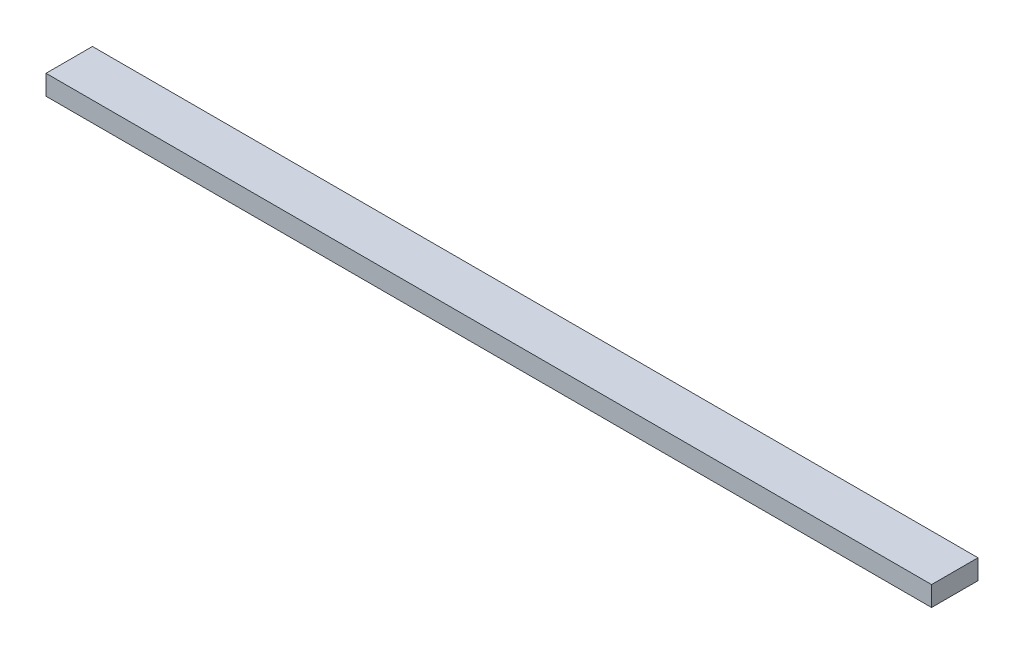
ISO-10303-21;
HEADER;
FILE_DESCRIPTION(('STEP AP214'),'2;1');
FILE_NAME('part.step','',(''),(''),'','','');
FILE_SCHEMA(('AUTOMOTIVE_DESIGN { 1 0 10303 214 1 1 1 1 }'));
ENDSEC;
DATA;
#1=APPLICATION_CONTEXT('core data for automotive mechanical design processes');
#2=APPLICATION_PROTOCOL_DEFINITION('international standard','automotive_design',2000,#1);
#3=PRODUCT_CONTEXT('',#1,'mechanical');
#4=PRODUCT('Part','Part','',(#3));
#5=PRODUCT_RELATED_PRODUCT_CATEGORY('part','',(#4));
#6=PRODUCT_DEFINITION_FORMATION('','',#4);
#7=PRODUCT_DEFINITION_CONTEXT('part definition',#1,'design');
#8=PRODUCT_DEFINITION('design','',#6,#7);
#9=PRODUCT_DEFINITION_SHAPE('','',#8);
#10=(LENGTH_UNIT() NAMED_UNIT(*) SI_UNIT(.MILLI.,.METRE.));
#11=(NAMED_UNIT(*) PLANE_ANGLE_UNIT() SI_UNIT($,.RADIAN.));
#12=(NAMED_UNIT(*) SI_UNIT($,.STERADIAN.) SOLID_ANGLE_UNIT());
#13=UNCERTAINTY_MEASURE_WITH_UNIT(LENGTH_MEASURE(1.E-05),#10,'distance_accuracy_value','');
#14=(GEOMETRIC_REPRESENTATION_CONTEXT(3) GLOBAL_UNCERTAINTY_ASSIGNED_CONTEXT((#13)) GLOBAL_UNIT_ASSIGNED_CONTEXT((#10,
#11,#12)) REPRESENTATION_CONTEXT('',''));
#15=CARTESIAN_POINT('',(0.,0.,0.));
#16=DIRECTION('',(0.,0.,1.));
#17=DIRECTION('',(1.,0.,0.));
#18=AXIS2_PLACEMENT_3D('',#15,#16,#17);
#19=CARTESIAN_POINT('',(0.,38.1,0.));
#20=DIRECTION('',(1.,0.,0.));
#21=DIRECTION('',(0.,0.,-1.));
#22=AXIS2_PLACEMENT_3D('',#19,#20,#21);
#23=PLANE('',#22);
#24=DIRECTION('',(0.,0.,1.));
#25=VECTOR('',#24,1.);
#26=CARTESIAN_POINT('',(0.,0.,0.));
#27=LINE('',#26,#25);
#28=CARTESIAN_POINT('',(0.,0.,-88.9));
#29=VERTEX_POINT('',#28);
#30=CARTESIAN_POINT('',(0.,0.,0.));
#31=VERTEX_POINT('',#30);
#32=EDGE_CURVE('E102',#29,#31,#27,.T.);
#33=ORIENTED_EDGE('',*,*,#32,.T.);
#34=DIRECTION('',(0.,-1.,0.));
#35=VECTOR('',#34,1.);
#36=CARTESIAN_POINT('',(0.,38.1,0.));
#37=LINE('',#36,#35);
#38=CARTESIAN_POINT('',(0.,38.1,0.));
#39=VERTEX_POINT('',#38);
#40=EDGE_CURVE('E11',#39,#31,#37,.T.);
#41=ORIENTED_EDGE('',*,*,#40,.F.);
#42=DIRECTION('',(0.,0.,1.));
#43=VECTOR('',#42,1.);
#44=CARTESIAN_POINT('',(0.,38.1,0.));
#45=LINE('',#44,#43);
#46=CARTESIAN_POINT('',(0.,38.1,-88.9));
#47=VERTEX_POINT('',#46);
#48=EDGE_CURVE('E90',#47,#39,#45,.T.);
#49=ORIENTED_EDGE('',*,*,#48,.F.);
#50=DIRECTION('',(0.,-1.,0.));
#51=VECTOR('',#50,1.);
#52=CARTESIAN_POINT('',(0.,38.1,-88.9));
#53=LINE('',#52,#51);
#54=EDGE_CURVE('E98',#47,#29,#53,.T.);
#55=ORIENTED_EDGE('',*,*,#54,.T.);
#56=EDGE_LOOP('',(#33,#41,#49,#55));
#57=FACE_BOUND('',#56,.T.);
#58=ADVANCED_FACE('F39',(#57),#23,.F.);
#59=CARTESIAN_POINT('',(0.,38.1,0.));
#60=DIRECTION('',(0.,0.,-1.));
#61=DIRECTION('',(-1.,0.,0.));
#62=AXIS2_PLACEMENT_3D('',#59,#60,#61);
#63=PLANE('',#62);
#64=DIRECTION('',(1.,0.,0.));
#65=VECTOR('',#64,1.);
#66=CARTESIAN_POINT('',(0.,0.,0.));
#67=LINE('',#66,#65);
#68=CARTESIAN_POINT('',(1695.45,0.,0.));
#69=VERTEX_POINT('',#68);
#70=EDGE_CURVE('E94',#31,#69,#67,.T.);
#71=ORIENTED_EDGE('',*,*,#70,.T.);
#72=DIRECTION('',(0.,-1.,0.));
#73=VECTOR('',#72,1.);
#74=CARTESIAN_POINT('',(1695.45,38.1,0.));
#75=LINE('',#74,#73);
#76=CARTESIAN_POINT('',(1695.45,38.1,0.));
#77=VERTEX_POINT('',#76);
#78=EDGE_CURVE('E47',#77,#69,#75,.T.);
#79=ORIENTED_EDGE('',*,*,#78,.F.);
#80=DIRECTION('',(1.,0.,0.));
#81=VECTOR('',#80,1.);
#82=CARTESIAN_POINT('',(0.,38.1,0.));
#83=LINE('',#82,#81);
#84=EDGE_CURVE('E85',#39,#77,#83,.T.);
#85=ORIENTED_EDGE('',*,*,#84,.F.);
#86=ORIENTED_EDGE('',*,*,#40,.T.);
#87=EDGE_LOOP('',(#71,#79,#85,#86));
#88=FACE_BOUND('',#87,.T.);
#89=ADVANCED_FACE('F93',(#88),#63,.F.);
#90=CARTESIAN_POINT('',(1695.45,38.1,0.));
#91=DIRECTION('',(-1.,0.,0.));
#92=DIRECTION('',(0.,0.,1.));
#93=AXIS2_PLACEMENT_3D('',#90,#91,#92);
#94=PLANE('',#93);
#95=DIRECTION('',(0.,0.,-1.));
#96=VECTOR('',#95,1.);
#97=CARTESIAN_POINT('',(1695.45,0.,0.));
#98=LINE('',#97,#96);
#99=CARTESIAN_POINT('',(1695.45,0.,-88.9));
#100=VERTEX_POINT('',#99);
#101=EDGE_CURVE('E72',#69,#100,#98,.T.);
#102=ORIENTED_EDGE('',*,*,#101,.T.);
#103=DIRECTION('',(0.,-1.,0.));
#104=VECTOR('',#103,1.);
#105=CARTESIAN_POINT('',(1695.45,38.1,-88.9));
#106=LINE('',#105,#104);
#107=CARTESIAN_POINT('',(1695.45,38.1,-88.9));
#108=VERTEX_POINT('',#107);
#109=EDGE_CURVE('E95',#108,#100,#106,.T.);
#110=ORIENTED_EDGE('',*,*,#109,.F.);
#111=DIRECTION('',(0.,0.,-1.));
#112=VECTOR('',#111,1.);
#113=CARTESIAN_POINT('',(1695.45,38.1,0.));
#114=LINE('',#113,#112);
#115=EDGE_CURVE('E88',#77,#108,#114,.T.);
#116=ORIENTED_EDGE('',*,*,#115,.F.);
#117=ORIENTED_EDGE('',*,*,#78,.T.);
#118=EDGE_LOOP('',(#102,#110,#116,#117));
#119=FACE_BOUND('',#118,.T.);
#120=ADVANCED_FACE('F96',(#119),#94,.F.);
#121=CARTESIAN_POINT('',(0.,38.1,-88.9));
#122=DIRECTION('',(0.,0.,1.));
#123=DIRECTION('',(1.,0.,0.));
#124=AXIS2_PLACEMENT_3D('',#121,#122,#123);
#125=PLANE('',#124);
#126=DIRECTION('',(-1.,0.,0.));
#127=VECTOR('',#126,1.);
#128=CARTESIAN_POINT('',(0.,0.,-88.9));
#129=LINE('',#128,#127);
#130=EDGE_CURVE('E78',#100,#29,#129,.T.);
#131=ORIENTED_EDGE('',*,*,#130,.T.);
#132=ORIENTED_EDGE('',*,*,#54,.F.);
#133=DIRECTION('',(-1.,0.,0.));
#134=VECTOR('',#133,1.);
#135=CARTESIAN_POINT('',(0.,38.1,-88.9));
#136=LINE('',#135,#134);
#137=EDGE_CURVE('E55',#108,#47,#136,.T.);
#138=ORIENTED_EDGE('',*,*,#137,.F.);
#139=ORIENTED_EDGE('',*,*,#109,.T.);
#140=EDGE_LOOP('',(#131,#132,#138,#139));
#141=FACE_BOUND('',#140,.T.);
#142=ADVANCED_FACE('F109',(#141),#125,.F.);
#143=CARTESIAN_POINT('',(0.,38.1,0.));
#144=DIRECTION('',(0.,-1.,0.));
#145=DIRECTION('',(0.,0.,-1.));
#146=AXIS2_PLACEMENT_3D('',#143,#144,#145);
#147=PLANE('',#146);
#148=ORIENTED_EDGE('',*,*,#48,.T.);
#149=ORIENTED_EDGE('',*,*,#84,.T.);
#150=ORIENTED_EDGE('',*,*,#115,.T.);
#151=ORIENTED_EDGE('',*,*,#137,.T.);
#152=EDGE_LOOP('',(#148,#149,#150,#151));
#153=FACE_BOUND('',#152,.T.);
#154=ADVANCED_FACE('F86',(#153),#147,.F.);
#155=CARTESIAN_POINT('',(0.,0.,0.));
#156=DIRECTION('',(0.,-1.,0.));
#157=DIRECTION('',(0.,0.,-1.));
#158=AXIS2_PLACEMENT_3D('',#155,#156,#157);
#159=PLANE('',#158);
#160=ORIENTED_EDGE('',*,*,#32,.F.);
#161=ORIENTED_EDGE('',*,*,#130,.F.);
#162=ORIENTED_EDGE('',*,*,#101,.F.);
#163=ORIENTED_EDGE('',*,*,#70,.F.);
#164=EDGE_LOOP('',(#160,#161,#162,#163));
#165=FACE_BOUND('',#164,.T.);
#166=ADVANCED_FACE('F112',(#165),#159,.T.);
#167=CLOSED_SHELL('',(#58,#89,#120,#142,#154,#166));
#168=MANIFOLD_SOLID_BREP('B2',#167);
#169=ADVANCED_BREP_SHAPE_REPRESENTATION('',(#18,#168),#14);
#170=SHAPE_DEFINITION_REPRESENTATION(#9,#169);
ENDSEC;
END-ISO-10303-21;
